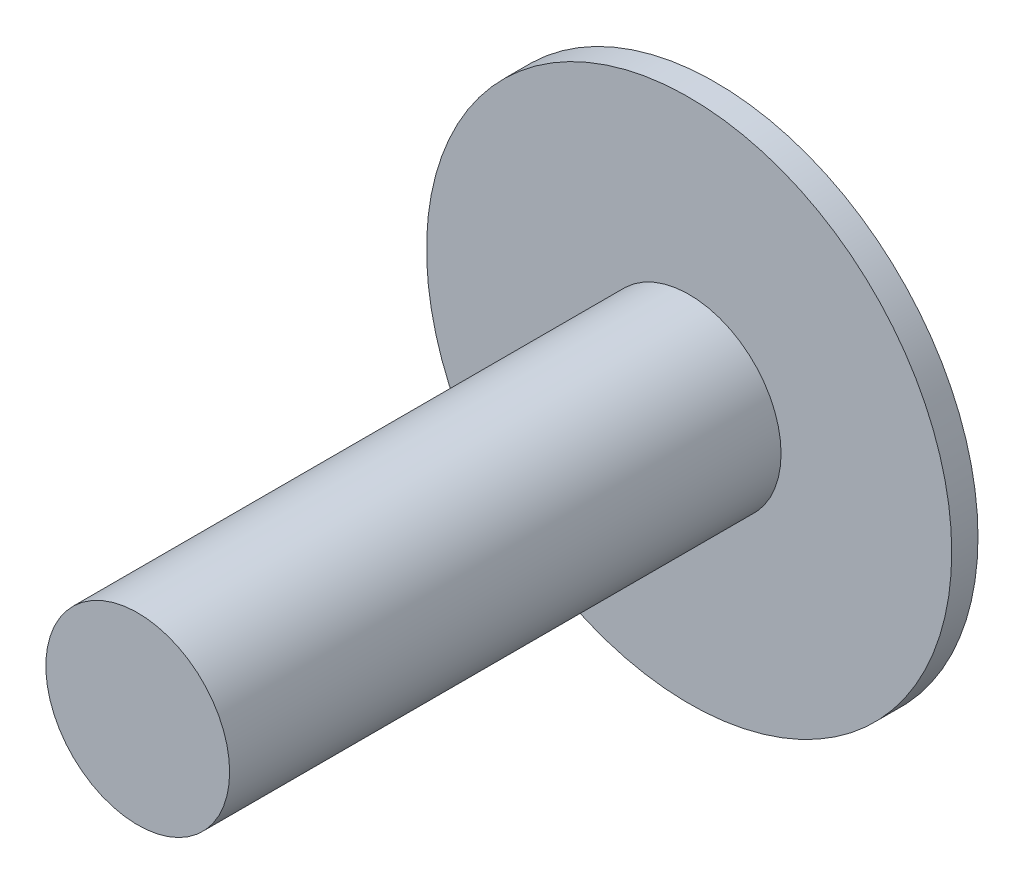
ISO-10303-21;
HEADER;
FILE_DESCRIPTION(('STEP AP214'),'2;1');
FILE_NAME('part.step','',(''),(''),'','','');
FILE_SCHEMA(('AUTOMOTIVE_DESIGN { 1 0 10303 214 1 1 1 1 }'));
ENDSEC;
DATA;
#1=APPLICATION_CONTEXT('core data for automotive mechanical design processes');
#2=APPLICATION_PROTOCOL_DEFINITION('international standard','automotive_design',2000,#1);
#3=PRODUCT_CONTEXT('',#1,'mechanical');
#4=PRODUCT('Part','Part','',(#3));
#5=PRODUCT_RELATED_PRODUCT_CATEGORY('part','',(#4));
#6=PRODUCT_DEFINITION_FORMATION('','',#4);
#7=PRODUCT_DEFINITION_CONTEXT('part definition',#1,'design');
#8=PRODUCT_DEFINITION('design','',#6,#7);
#9=PRODUCT_DEFINITION_SHAPE('','',#8);
#10=(LENGTH_UNIT() NAMED_UNIT(*) SI_UNIT(.MILLI.,.METRE.));
#11=(NAMED_UNIT(*) PLANE_ANGLE_UNIT() SI_UNIT($,.RADIAN.));
#12=(NAMED_UNIT(*) SI_UNIT($,.STERADIAN.) SOLID_ANGLE_UNIT());
#13=UNCERTAINTY_MEASURE_WITH_UNIT(LENGTH_MEASURE(1.E-05),#10,'distance_accuracy_value','');
#14=(GEOMETRIC_REPRESENTATION_CONTEXT(3) GLOBAL_UNCERTAINTY_ASSIGNED_CONTEXT((#13)) GLOBAL_UNIT_ASSIGNED_CONTEXT((#10,
#11,#12)) REPRESENTATION_CONTEXT('',''));
#15=CARTESIAN_POINT('',(0.,0.,0.));
#16=DIRECTION('',(0.,0.,1.));
#17=DIRECTION('',(1.,0.,0.));
#18=AXIS2_PLACEMENT_3D('',#15,#16,#17);
#19=CARTESIAN_POINT('',(0.,0.,1.));
#20=DIRECTION('',(0.,0.,-1.));
#21=DIRECTION('',(-1.,0.,0.));
#22=AXIS2_PLACEMENT_3D('',#19,#20,#21);
#23=CYLINDRICAL_SURFACE('',#22,10.);
#24=CARTESIAN_POINT('',(0.,0.,1.));
#25=DIRECTION('',(0.,0.,1.));
#26=DIRECTION('',(1.,0.,0.));
#27=AXIS2_PLACEMENT_3D('',#24,#25,#26);
#28=CIRCLE('',#27,10.);
#29=CARTESIAN_POINT('',(10.,0.,1.));
#30=VERTEX_POINT('',#29);
#31=EDGE_CURVE('E45',#30,#30,#28,.T.);
#32=ORIENTED_EDGE('',*,*,#31,.F.);
#33=EDGE_LOOP('',(#32));
#34=FACE_BOUND('',#33,.T.);
#35=CARTESIAN_POINT('',(0.,0.,0.));
#36=DIRECTION('',(0.,0.,1.));
#37=DIRECTION('',(1.,0.,0.));
#38=AXIS2_PLACEMENT_3D('',#35,#36,#37);
#39=CIRCLE('',#38,10.);
#40=CARTESIAN_POINT('',(10.,0.,0.));
#41=VERTEX_POINT('',#40);
#42=EDGE_CURVE('E40',#41,#41,#39,.T.);
#43=ORIENTED_EDGE('',*,*,#42,.T.);
#44=EDGE_LOOP('',(#43));
#45=FACE_BOUND('',#44,.T.);
#46=ADVANCED_FACE('F37',(#34,#45),#23,.T.);
#47=CARTESIAN_POINT('',(0.,0.,1.));
#48=DIRECTION('',(0.,0.,1.));
#49=DIRECTION('',(1.,0.,0.));
#50=AXIS2_PLACEMENT_3D('',#47,#48,#49);
#51=PLANE('',#50);
#52=CARTESIAN_POINT('',(0.,0.,1.));
#53=DIRECTION('',(0.,0.,1.));
#54=DIRECTION('',(1.,0.,0.));
#55=AXIS2_PLACEMENT_3D('',#52,#53,#54);
#56=CIRCLE('',#55,3.5);
#57=CARTESIAN_POINT('',(3.5,0.,1.));
#58=VERTEX_POINT('',#57);
#59=EDGE_CURVE('E10',#58,#58,#56,.T.);
#60=ORIENTED_EDGE('',*,*,#59,.F.);
#61=EDGE_LOOP('',(#60));
#62=FACE_BOUND('',#61,.T.);
#63=ORIENTED_EDGE('',*,*,#31,.T.);
#64=EDGE_LOOP('',(#63));
#65=FACE_BOUND('',#64,.T.);
#66=ADVANCED_FACE('F65',(#62,#65),#51,.T.);
#67=CARTESIAN_POINT('',(0.,0.,0.));
#68=DIRECTION('',(0.,0.,1.));
#69=DIRECTION('',(1.,0.,0.));
#70=AXIS2_PLACEMENT_3D('',#67,#68,#69);
#71=PLANE('',#70);
#72=ORIENTED_EDGE('',*,*,#42,.F.);
#73=EDGE_LOOP('',(#72));
#74=FACE_BOUND('',#73,.T.);
#75=ADVANCED_FACE('F62',(#74),#71,.F.);
#76=CARTESIAN_POINT('',(0.,0.,22.));
#77=DIRECTION('',(0.,0.,-1.));
#78=DIRECTION('',(-1.,0.,0.));
#79=AXIS2_PLACEMENT_3D('',#76,#77,#78);
#80=CYLINDRICAL_SURFACE('',#79,3.5);
#81=CARTESIAN_POINT('',(0.,0.,22.));
#82=DIRECTION('',(0.,0.,1.));
#83=DIRECTION('',(1.,0.,0.));
#84=AXIS2_PLACEMENT_3D('',#81,#82,#83);
#85=CIRCLE('',#84,3.5);
#86=CARTESIAN_POINT('',(3.5,0.,22.));
#87=VERTEX_POINT('',#86);
#88=EDGE_CURVE('E52',#87,#87,#85,.T.);
#89=ORIENTED_EDGE('',*,*,#88,.F.);
#90=EDGE_LOOP('',(#89));
#91=FACE_BOUND('',#90,.T.);
#92=ORIENTED_EDGE('',*,*,#59,.T.);
#93=EDGE_LOOP('',(#92));
#94=FACE_BOUND('',#93,.T.);
#95=ADVANCED_FACE('F64',(#91,#94),#80,.T.);
#96=CARTESIAN_POINT('',(0.,0.,22.));
#97=DIRECTION('',(0.,0.,1.));
#98=DIRECTION('',(1.,0.,0.));
#99=AXIS2_PLACEMENT_3D('',#96,#97,#98);
#100=PLANE('',#99);
#101=ORIENTED_EDGE('',*,*,#88,.T.);
#102=EDGE_LOOP('',(#101));
#103=FACE_BOUND('',#102,.T.);
#104=ADVANCED_FACE('F70',(#103),#100,.T.);
#105=CLOSED_SHELL('',(#46,#66,#75,#95,#104));
#106=MANIFOLD_SOLID_BREP('B2',#105);
#107=ADVANCED_BREP_SHAPE_REPRESENTATION('',(#18,#106),#14);
#108=SHAPE_DEFINITION_REPRESENTATION(#9,#107);
ENDSEC;
END-ISO-10303-21;
